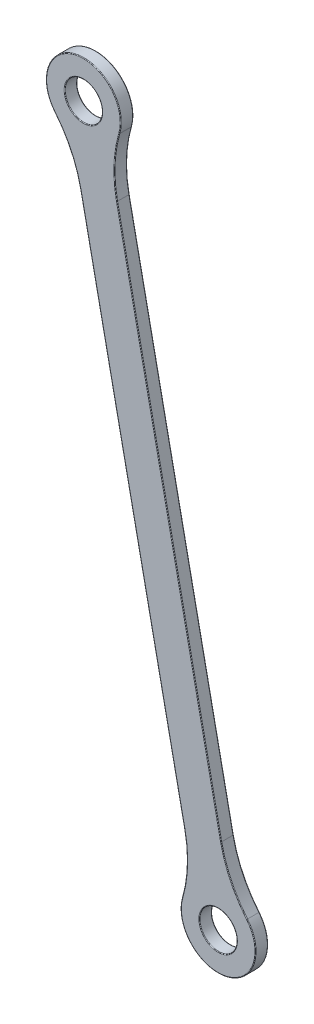
ISO-10303-21;
HEADER;
FILE_DESCRIPTION(('STEP AP214'),'2;1');
FILE_NAME('part.step','',(''),(''),'','','');
FILE_SCHEMA(('AUTOMOTIVE_DESIGN { 1 0 10303 214 1 1 1 1 }'));
ENDSEC;
DATA;
#1=APPLICATION_CONTEXT('core data for automotive mechanical design processes');
#2=APPLICATION_PROTOCOL_DEFINITION('international standard','automotive_design',2000,#1);
#3=PRODUCT_CONTEXT('',#1,'mechanical');
#4=PRODUCT('Part','Part','',(#3));
#5=PRODUCT_RELATED_PRODUCT_CATEGORY('part','',(#4));
#6=PRODUCT_DEFINITION_FORMATION('','',#4);
#7=PRODUCT_DEFINITION_CONTEXT('part definition',#1,'design');
#8=PRODUCT_DEFINITION('design','',#6,#7);
#9=PRODUCT_DEFINITION_SHAPE('','',#8);
#10=(LENGTH_UNIT() NAMED_UNIT(*) SI_UNIT(.MILLI.,.METRE.));
#11=(NAMED_UNIT(*) PLANE_ANGLE_UNIT() SI_UNIT($,.RADIAN.));
#12=(NAMED_UNIT(*) SI_UNIT($,.STERADIAN.) SOLID_ANGLE_UNIT());
#13=UNCERTAINTY_MEASURE_WITH_UNIT(LENGTH_MEASURE(1.E-05),#10,'distance_accuracy_value','');
#14=(GEOMETRIC_REPRESENTATION_CONTEXT(3) GLOBAL_UNCERTAINTY_ASSIGNED_CONTEXT((#13)) GLOBAL_UNIT_ASSIGNED_CONTEXT((#10,
#11,#12)) REPRESENTATION_CONTEXT('',''));
#15=CARTESIAN_POINT('',(0.,0.,0.));
#16=DIRECTION('',(0.,0.,1.));
#17=DIRECTION('',(1.,0.,0.));
#18=AXIS2_PLACEMENT_3D('',#15,#16,#17);
#19=CARTESIAN_POINT('',(33.78,49.7570889759445,3.));
#20=DIRECTION('',(0.,0.,-1.));
#21=DIRECTION('',(-1.,0.,0.));
#22=AXIS2_PLACEMENT_3D('',#19,#20,#21);
#23=CYLINDRICAL_SURFACE('',#22,9.);
#24=DIRECTION('',(0.,0.,-1.));
#25=VECTOR('',#24,1.);
#26=CARTESIAN_POINT('',(25.1327859363434,52.252222025964,3.));
#27=LINE('',#26,#25);
#28=CARTESIAN_POINT('',(25.1327859363434,52.252222025964,2.85));
#29=VERTEX_POINT('',#28);
#30=CARTESIAN_POINT('',(25.1327859363434,52.252222025964,0.15));
#31=VERTEX_POINT('',#30);
#32=EDGE_CURVE('E333',#29,#31,#27,.T.);
#33=ORIENTED_EDGE('',*,*,#32,.T.);
#34=CARTESIAN_POINT('',(33.78,49.7570889759445,0.15));
#35=DIRECTION('',(0.,0.,1.));
#36=DIRECTION('',(1.,0.,0.));
#37=AXIS2_PLACEMENT_3D('',#34,#35,#36);
#38=CIRCLE('',#37,9.);
#39=CARTESIAN_POINT('',(40.7250033658496,55.4813293839233,0.15));
#40=VERTEX_POINT('',#39);
#41=EDGE_CURVE('E223',#31,#40,#38,.T.);
#42=ORIENTED_EDGE('',*,*,#41,.T.);
#43=DIRECTION('',(0.,0.,-1.));
#44=VECTOR('',#43,1.);
#45=CARTESIAN_POINT('',(40.7250033658496,55.4813293839233,3.));
#46=LINE('',#45,#44);
#47=CARTESIAN_POINT('',(40.7250033658496,55.4813293839233,2.85));
#48=VERTEX_POINT('',#47);
#49=EDGE_CURVE('E295',#40,#48,#46,.F.);
#50=ORIENTED_EDGE('',*,*,#49,.T.);
#51=CARTESIAN_POINT('',(33.78,49.7570889759445,2.85));
#52=DIRECTION('',(0.,0.,1.));
#53=DIRECTION('',(1.,0.,0.));
#54=AXIS2_PLACEMENT_3D('',#51,#52,#53);
#55=CIRCLE('',#54,9.);
#56=EDGE_CURVE('E221',#48,#29,#55,.F.);
#57=ORIENTED_EDGE('',*,*,#56,.T.);
#58=EDGE_LOOP('',(#33,#42,#50,#57));
#59=FACE_BOUND('',#58,.T.);
#60=ADVANCED_FACE('F35',(#59),#23,.T.);
#61=CARTESIAN_POINT('',(46.6780601183593,9.66690389387618,3.));
#62=DIRECTION('',(-0.979221384461745,-0.202794181900822,0.));
#63=DIRECTION('',(0.202794181900822,-0.979221384461745,0.));
#64=AXIS2_PLACEMENT_3D('',#61,#62,#63);
#65=PLANE('',#64);
#66=DIRECTION('',(0.,0.,1.));
#67=VECTOR('',#66,1.);
#68=CARTESIAN_POINT('',(34.4983730514961,68.4783052868279,0.));
#69=LINE('',#68,#67);
#70=CARTESIAN_POINT('',(34.4983730514961,68.4783052868279,2.85));
#71=VERTEX_POINT('',#70);
#72=CARTESIAN_POINT('',(34.4983730514961,68.4783052868279,0.15));
#73=VERTEX_POINT('',#72);
#74=EDGE_CURVE('E297',#71,#73,#69,.F.);
#75=ORIENTED_EDGE('',*,*,#74,.T.);
#76=DIRECTION('',(-0.202794181900822,0.979221384461745,0.));
#77=VECTOR('',#76,1.);
#78=CARTESIAN_POINT('',(46.6780601183593,9.66690389387618,0.15));
#79=LINE('',#78,#77);
#80=CARTESIAN_POINT('',(9.42755030452798,189.536441816048,0.15));
#81=VERTEX_POINT('',#80);
#82=EDGE_CURVE('E198',#73,#81,#79,.T.);
#83=ORIENTED_EDGE('',*,*,#82,.T.);
#84=DIRECTION('',(0.,0.,1.));
#85=VECTOR('',#84,1.);
#86=CARTESIAN_POINT('',(9.42755030452798,189.536441816048,3.));
#87=LINE('',#86,#85);
#88=CARTESIAN_POINT('',(9.42755030452798,189.536441816048,2.85));
#89=VERTEX_POINT('',#88);
#90=EDGE_CURVE('E331',#81,#89,#87,.T.);
#91=ORIENTED_EDGE('',*,*,#90,.T.);
#92=DIRECTION('',(-0.202794181900822,0.979221384461745,0.));
#93=VECTOR('',#92,1.);
#94=CARTESIAN_POINT('',(34.4983730514961,68.4783052868279,2.85));
#95=LINE('',#94,#93);
#96=EDGE_CURVE('E196',#89,#71,#95,.F.);
#97=ORIENTED_EDGE('',*,*,#96,.T.);
#98=EDGE_LOOP('',(#75,#83,#91,#97));
#99=FACE_BOUND('',#98,.T.);
#100=ADVANCED_FACE('F330',(#99),#65,.F.);
#101=CARTESIAN_POINT('',(1.33293089586844,206.432510489824,3.));
#102=DIRECTION('',(0.,0.,-1.));
#103=DIRECTION('',(-1.,0.,0.));
#104=AXIS2_PLACEMENT_3D('',#101,#102,#103);
#105=CYLINDRICAL_SURFACE('',#104,9.);
#106=DIRECTION('',(0.,0.,-1.));
#107=VECTOR('',#106,1.);
#108=CARTESIAN_POINT('',(9.98014495952503,203.937377439804,3.));
#109=LINE('',#108,#107);
#110=CARTESIAN_POINT('',(9.98014495952503,203.937377439804,2.85));
#111=VERTEX_POINT('',#110);
#112=CARTESIAN_POINT('',(9.98014495952503,203.937377439804,0.15));
#113=VERTEX_POINT('',#112);
#114=EDGE_CURVE('E334',#111,#113,#109,.T.);
#115=ORIENTED_EDGE('',*,*,#114,.T.);
#116=CARTESIAN_POINT('',(1.33293089586844,206.432510489824,0.15));
#117=DIRECTION('',(0.,0.,1.));
#118=DIRECTION('',(1.,0.,0.));
#119=AXIS2_PLACEMENT_3D('',#116,#117,#118);
#120=CIRCLE('',#119,9.);
#121=CARTESIAN_POINT('',(-5.61207246998122,200.708270081845,0.15));
#122=VERTEX_POINT('',#121);
#123=EDGE_CURVE('E206',#113,#122,#120,.T.);
#124=ORIENTED_EDGE('',*,*,#123,.T.);
#125=DIRECTION('',(0.,0.,-1.));
#126=VECTOR('',#125,1.);
#127=CARTESIAN_POINT('',(-5.61207246998122,200.708270081845,3.));
#128=LINE('',#127,#126);
#129=CARTESIAN_POINT('',(-5.61207246998122,200.708270081845,2.85));
#130=VERTEX_POINT('',#129);
#131=EDGE_CURVE('E338',#122,#130,#128,.F.);
#132=ORIENTED_EDGE('',*,*,#131,.T.);
#133=CARTESIAN_POINT('',(1.33293089586844,206.432510489824,2.85));
#134=DIRECTION('',(0.,0.,1.));
#135=DIRECTION('',(1.,0.,0.));
#136=AXIS2_PLACEMENT_3D('',#133,#134,#135);
#137=CIRCLE('',#136,9.);
#138=EDGE_CURVE('E204',#130,#111,#137,.F.);
#139=ORIENTED_EDGE('',*,*,#138,.T.);
#140=EDGE_LOOP('',(#115,#124,#132,#139));
#141=FACE_BOUND('',#140,.T.);
#142=ADVANCED_FACE('F371',(#141),#105,.T.);
#143=CARTESIAN_POINT('',(1.33293089586844,206.432510489824,3.));
#144=DIRECTION('',(0.,0.,-1.));
#145=DIRECTION('',(-1.,0.,0.));
#146=AXIS2_PLACEMENT_3D('',#143,#144,#145);
#147=CYLINDRICAL_SURFACE('',#146,4.5);
#148=CARTESIAN_POINT('',(1.33293089586844,206.432510489824,0.15));
#149=DIRECTION('',(0.,0.,1.));
#150=DIRECTION('',(1.,0.,0.));
#151=AXIS2_PLACEMENT_3D('',#148,#149,#150);
#152=CIRCLE('',#151,4.5);
#153=CARTESIAN_POINT('',(5.83293089586845,206.432510489824,0.15));
#154=VERTEX_POINT('',#153);
#155=EDGE_CURVE('E190',#154,#154,#152,.F.);
#156=ORIENTED_EDGE('',*,*,#155,.T.);
#157=EDGE_LOOP('',(#156));
#158=FACE_BOUND('',#157,.T.);
#159=CARTESIAN_POINT('',(1.33293089586844,206.432510489824,2.85));
#160=DIRECTION('',(0.,0.,1.));
#161=DIRECTION('',(1.,0.,0.));
#162=AXIS2_PLACEMENT_3D('',#159,#160,#161);
#163=CIRCLE('',#162,4.5);
#164=CARTESIAN_POINT('',(5.83293089586845,206.432510489824,2.85));
#165=VERTEX_POINT('',#164);
#166=EDGE_CURVE('E187',#165,#165,#163,.T.);
#167=ORIENTED_EDGE('',*,*,#166,.T.);
#168=EDGE_LOOP('',(#167));
#169=FACE_BOUND('',#168,.T.);
#170=ADVANCED_FACE('F619',(#158,#169),#147,.F.);
#171=CARTESIAN_POINT('',(37.8650676582036,7.84175625676878,3.));
#172=DIRECTION('',(-0.979221384461745,-0.202794181900822,0.));
#173=DIRECTION('',(0.202794181900822,-0.979221384461745,0.));
#174=AXIS2_PLACEMENT_3D('',#171,#172,#173);
#175=PLANE('',#174);
#176=DIRECTION('',(0.,0.,-1.));
#177=VECTOR('',#176,1.);
#178=CARTESIAN_POINT('',(0.614557844372268,187.71129417894,3.));
#179=LINE('',#178,#177);
#180=CARTESIAN_POINT('',(0.614557844372268,187.71129417894,2.85));
#181=VERTEX_POINT('',#180);
#182=CARTESIAN_POINT('',(0.614557844372268,187.71129417894,0.15));
#183=VERTEX_POINT('',#182);
#184=EDGE_CURVE('E258',#181,#183,#179,.T.);
#185=ORIENTED_EDGE('',*,*,#184,.T.);
#186=DIRECTION('',(-0.202794181900822,0.979221384461745,0.));
#187=VECTOR('',#186,1.);
#188=CARTESIAN_POINT('',(25.6853805913405,66.6531576497204,0.15));
#189=LINE('',#188,#187);
#190=CARTESIAN_POINT('',(25.6853805913405,66.6531576497204,0.15));
#191=VERTEX_POINT('',#190);
#192=EDGE_CURVE('E215',#183,#191,#189,.F.);
#193=ORIENTED_EDGE('',*,*,#192,.T.);
#194=DIRECTION('',(0.,0.,-1.));
#195=VECTOR('',#194,1.);
#196=CARTESIAN_POINT('',(25.6853805913405,66.6531576497204,3.));
#197=LINE('',#196,#195);
#198=CARTESIAN_POINT('',(25.6853805913405,66.6531576497204,2.85));
#199=VERTEX_POINT('',#198);
#200=EDGE_CURVE('E305',#191,#199,#197,.F.);
#201=ORIENTED_EDGE('',*,*,#200,.T.);
#202=DIRECTION('',(-0.202794181900822,0.979221384461745,0.));
#203=VECTOR('',#202,1.);
#204=CARTESIAN_POINT('',(37.8650676582036,7.84175625676878,2.85));
#205=LINE('',#204,#203);
#206=EDGE_CURVE('E213',#199,#181,#205,.T.);
#207=ORIENTED_EDGE('',*,*,#206,.T.);
#208=EDGE_LOOP('',(#185,#193,#201,#207));
#209=FACE_BOUND('',#208,.T.);
#210=ADVANCED_FACE('F346',(#209),#175,.T.);
#211=CARTESIAN_POINT('',(33.78,49.7570889759445,3.));
#212=DIRECTION('',(0.,0.,-1.));
#213=DIRECTION('',(-1.,0.,0.));
#214=AXIS2_PLACEMENT_3D('',#211,#212,#213);
#215=CYLINDRICAL_SURFACE('',#214,4.5);
#216=CARTESIAN_POINT('',(33.78,49.7570889759445,0.15));
#217=DIRECTION('',(0.,0.,1.));
#218=DIRECTION('',(1.,0.,0.));
#219=AXIS2_PLACEMENT_3D('',#216,#217,#218);
#220=CIRCLE('',#219,4.5);
#221=CARTESIAN_POINT('',(38.28,49.7570889759445,0.15));
#222=VERTEX_POINT('',#221);
#223=EDGE_CURVE('E170',#222,#222,#220,.F.);
#224=ORIENTED_EDGE('',*,*,#223,.T.);
#225=EDGE_LOOP('',(#224));
#226=FACE_BOUND('',#225,.T.);
#227=CARTESIAN_POINT('',(33.78,49.7570889759445,2.85));
#228=DIRECTION('',(0.,0.,1.));
#229=DIRECTION('',(1.,0.,0.));
#230=AXIS2_PLACEMENT_3D('',#227,#228,#229);
#231=CIRCLE('',#230,4.5);
#232=CARTESIAN_POINT('',(38.28,49.7570889759445,2.85));
#233=VERTEX_POINT('',#232);
#234=EDGE_CURVE('E301',#233,#233,#231,.T.);
#235=ORIENTED_EDGE('',*,*,#234,.T.);
#236=EDGE_LOOP('',(#235));
#237=FACE_BOUND('',#236,.T.);
#238=ADVANCED_FACE('F604',(#226,#237),#215,.F.);
#239=CARTESIAN_POINT('',(0.,0.,3.));
#240=DIRECTION('',(0.,0.,1.));
#241=DIRECTION('',(1.,0.,0.));
#242=AXIS2_PLACEMENT_3D('',#239,#240,#241);
#243=PLANE('',#242);
#244=CARTESIAN_POINT('',(33.78,49.7570889759445,3.));
#245=DIRECTION('',(0.,0.,1.));
#246=DIRECTION('',(1.,0.,0.));
#247=AXIS2_PLACEMENT_3D('',#244,#245,#246);
#248=CIRCLE('',#247,4.65);
#249=CARTESIAN_POINT('',(38.43,49.7570889759445,3.));
#250=VERTEX_POINT('',#249);
#251=EDGE_CURVE('E11',#250,#250,#248,.F.);
#252=ORIENTED_EDGE('',*,*,#251,.T.);
#253=EDGE_LOOP('',(#252));
#254=FACE_BOUND('',#253,.T.);
#255=CARTESIAN_POINT('',(1.33293089586844,206.432510489824,3.));
#256=DIRECTION('',(0.,0.,1.));
#257=DIRECTION('',(1.,0.,0.));
#258=AXIS2_PLACEMENT_3D('',#255,#256,#257);
#259=CIRCLE('',#258,4.65);
#260=CARTESIAN_POINT('',(5.98293089586845,206.432510489824,3.));
#261=VERTEX_POINT('',#260);
#262=EDGE_CURVE('E44',#261,#261,#259,.F.);
#263=ORIENTED_EDGE('',*,*,#262,.T.);
#264=EDGE_LOOP('',(#263));
#265=FACE_BOUND('',#264,.T.);
#266=CARTESIAN_POINT('',(1.33293089586844,206.432510489824,3.));
#267=DIRECTION('',(0.,0.,1.));
#268=DIRECTION('',(1.,0.,0.));
#269=AXIS2_PLACEMENT_3D('',#266,#267,#268);
#270=CIRCLE('',#269,8.85);
#271=CARTESIAN_POINT('',(9.83602472513076,203.978962990638,3.));
#272=VERTEX_POINT('',#271);
#273=CARTESIAN_POINT('',(-5.49632241388373,200.803674088645,3.));
#274=VERTEX_POINT('',#273);
#275=EDGE_CURVE('E52',#272,#274,#270,.T.);
#276=ORIENTED_EDGE('',*,*,#275,.T.);
#277=CARTESIAN_POINT('',(-28.7620836894801,181.627468721916,3.));
#278=DIRECTION('',(0.,0.,1.));
#279=DIRECTION('',(1.,0.,0.));
#280=AXIS2_PLACEMENT_3D('',#277,#278,#279);
#281=CIRCLE('',#280,30.15);
#282=CARTESIAN_POINT('',(0.76144105204153,187.741713306225,3.));
#283=VERTEX_POINT('',#282);
#284=EDGE_CURVE('E237',#274,#283,#281,.F.);
#285=ORIENTED_EDGE('',*,*,#284,.T.);
#286=DIRECTION('',(-0.202794181900822,0.979221384461745,0.));
#287=VECTOR('',#286,1.);
#288=CARTESIAN_POINT('',(38.0119508658728,7.8721753840539,3.));
#289=LINE('',#288,#287);
#290=CARTESIAN_POINT('',(25.8322637990097,66.6835767770055,3.));
#291=VERTEX_POINT('',#290);
#292=EDGE_CURVE('E225',#283,#291,#289,.F.);
#293=ORIENTED_EDGE('',*,*,#292,.T.);
#294=CARTESIAN_POINT('',(-3.69126094251188,60.5693321926957,3.));
#295=DIRECTION('',(0.,0.,1.));
#296=DIRECTION('',(1.,0.,0.));
#297=AXIS2_PLACEMENT_3D('',#294,#295,#296);
#298=CIRCLE('',#297,30.15);
#299=CARTESIAN_POINT('',(25.2769061707377,52.2106364751303,3.));
#300=VERTEX_POINT('',#299);
#301=EDGE_CURVE('E227',#291,#300,#298,.F.);
#302=ORIENTED_EDGE('',*,*,#301,.T.);
#303=CARTESIAN_POINT('',(33.78,49.7570889759445,3.));
#304=DIRECTION('',(0.,0.,1.));
#305=DIRECTION('',(1.,0.,0.));
#306=AXIS2_PLACEMENT_3D('',#303,#304,#305);
#307=CIRCLE('',#306,8.85);
#308=CARTESIAN_POINT('',(40.6092533097522,55.3859253771236,3.));
#309=VERTEX_POINT('',#308);
#310=EDGE_CURVE('E229',#300,#309,#307,.T.);
#311=ORIENTED_EDGE('',*,*,#310,.T.);
#312=CARTESIAN_POINT('',(63.8750145853485,74.5621307438525,3.));
#313=DIRECTION('',(0.,0.,1.));
#314=DIRECTION('',(1.,0.,0.));
#315=AXIS2_PLACEMENT_3D('',#312,#313,#314);
#316=CIRCLE('',#315,30.15);
#317=CARTESIAN_POINT('',(34.3514898438269,68.4478861595427,3.));
#318=VERTEX_POINT('',#317);
#319=EDGE_CURVE('E231',#309,#318,#316,.F.);
#320=ORIENTED_EDGE('',*,*,#319,.T.);
#321=DIRECTION('',(-0.202794181900822,0.979221384461745,0.));
#322=VECTOR('',#321,1.);
#323=CARTESIAN_POINT('',(9.28066709685869,189.506022688763,3.));
#324=LINE('',#323,#322);
#325=CARTESIAN_POINT('',(9.28066709685871,189.506022688763,3.));
#326=VERTEX_POINT('',#325);
#327=EDGE_CURVE('E233',#318,#326,#324,.T.);
#328=ORIENTED_EDGE('',*,*,#327,.T.);
#329=CARTESIAN_POINT('',(38.8041918383803,195.620267273072,3.));
#330=DIRECTION('',(0.,0.,1.));
#331=DIRECTION('',(1.,0.,0.));
#332=AXIS2_PLACEMENT_3D('',#329,#330,#331);
#333=CIRCLE('',#332,30.15);
#334=EDGE_CURVE('E57',#326,#272,#333,.F.);
#335=ORIENTED_EDGE('',*,*,#334,.T.);
#336=EDGE_LOOP('',(#276,#285,#293,#302,#311,#320,#328,#335));
#337=FACE_BOUND('',#336,.T.);
#338=ADVANCED_FACE('F389',(#254,#265,#337),#243,.T.);
#339=CARTESIAN_POINT('',(0.,0.,0.));
#340=DIRECTION('',(0.,0.,1.));
#341=DIRECTION('',(1.,0.,0.));
#342=AXIS2_PLACEMENT_3D('',#339,#340,#341);
#343=PLANE('',#342);
#344=CARTESIAN_POINT('',(33.78,49.7570889759445,0.));
#345=DIRECTION('',(0.,0.,1.));
#346=DIRECTION('',(1.,0.,0.));
#347=AXIS2_PLACEMENT_3D('',#344,#345,#346);
#348=CIRCLE('',#347,4.65);
#349=CARTESIAN_POINT('',(38.43,49.7570889759445,0.));
#350=VERTEX_POINT('',#349);
#351=EDGE_CURVE('E179',#350,#350,#348,.T.);
#352=ORIENTED_EDGE('',*,*,#351,.T.);
#353=EDGE_LOOP('',(#352));
#354=FACE_BOUND('',#353,.T.);
#355=CARTESIAN_POINT('',(1.33293089586844,206.432510489824,0.));
#356=DIRECTION('',(0.,0.,1.));
#357=DIRECTION('',(1.,0.,0.));
#358=AXIS2_PLACEMENT_3D('',#355,#356,#357);
#359=CIRCLE('',#358,4.65);
#360=CARTESIAN_POINT('',(5.98293089586845,206.432510489824,0.));
#361=VERTEX_POINT('',#360);
#362=EDGE_CURVE('E176',#361,#361,#359,.T.);
#363=ORIENTED_EDGE('',*,*,#362,.T.);
#364=EDGE_LOOP('',(#363));
#365=FACE_BOUND('',#364,.T.);
#366=DIRECTION('',(-0.202794181900822,0.979221384461745,0.));
#367=VECTOR('',#366,1.);
#368=CARTESIAN_POINT('',(46.53117691069,9.63648476659105,0.));
#369=LINE('',#368,#367);
#370=CARTESIAN_POINT('',(9.28066709685871,189.506022688763,0.));
#371=VERTEX_POINT('',#370);
#372=CARTESIAN_POINT('',(34.3514898438269,68.4478861595427,0.));
#373=VERTEX_POINT('',#372);
#374=EDGE_CURVE('E174',#371,#373,#369,.F.);
#375=ORIENTED_EDGE('',*,*,#374,.T.);
#376=CARTESIAN_POINT('',(63.8750145853485,74.5621307438525,0.));
#377=DIRECTION('',(0.,0.,1.));
#378=DIRECTION('',(1.,0.,0.));
#379=AXIS2_PLACEMENT_3D('',#376,#377,#378);
#380=CIRCLE('',#379,30.15);
#381=CARTESIAN_POINT('',(40.6092533097522,55.3859253771236,0.));
#382=VERTEX_POINT('',#381);
#383=EDGE_CURVE('E155',#373,#382,#380,.T.);
#384=ORIENTED_EDGE('',*,*,#383,.T.);
#385=CARTESIAN_POINT('',(33.78,49.7570889759445,0.));
#386=DIRECTION('',(0.,0.,1.));
#387=DIRECTION('',(1.,0.,0.));
#388=AXIS2_PLACEMENT_3D('',#385,#386,#387);
#389=CIRCLE('',#388,8.85);
#390=CARTESIAN_POINT('',(25.2769061707377,52.2106364751303,0.));
#391=VERTEX_POINT('',#390);
#392=EDGE_CURVE('E163',#382,#391,#389,.F.);
#393=ORIENTED_EDGE('',*,*,#392,.T.);
#394=CARTESIAN_POINT('',(-3.69126094251188,60.5693321926957,0.));
#395=DIRECTION('',(0.,0.,1.));
#396=DIRECTION('',(1.,0.,0.));
#397=AXIS2_PLACEMENT_3D('',#394,#395,#396);
#398=CIRCLE('',#397,30.15);
#399=CARTESIAN_POINT('',(25.8322637990097,66.6835767770055,0.));
#400=VERTEX_POINT('',#399);
#401=EDGE_CURVE('E169',#391,#400,#398,.T.);
#402=ORIENTED_EDGE('',*,*,#401,.T.);
#403=DIRECTION('',(-0.202794181900822,0.979221384461745,0.));
#404=VECTOR('',#403,1.);
#405=CARTESIAN_POINT('',(0.761441052041518,187.741713306226,0.));
#406=LINE('',#405,#404);
#407=CARTESIAN_POINT('',(0.76144105204153,187.741713306225,0.));
#408=VERTEX_POINT('',#407);
#409=EDGE_CURVE('E312',#400,#408,#406,.T.);
#410=ORIENTED_EDGE('',*,*,#409,.T.);
#411=CARTESIAN_POINT('',(-28.7620836894801,181.627468721916,0.));
#412=DIRECTION('',(0.,0.,1.));
#413=DIRECTION('',(1.,0.,0.));
#414=AXIS2_PLACEMENT_3D('',#411,#412,#413);
#415=CIRCLE('',#414,30.15);
#416=CARTESIAN_POINT('',(-5.49632241388373,200.803674088645,0.));
#417=VERTEX_POINT('',#416);
#418=EDGE_CURVE('E314',#408,#417,#415,.T.);
#419=ORIENTED_EDGE('',*,*,#418,.T.);
#420=CARTESIAN_POINT('',(1.33293089586844,206.432510489824,0.));
#421=DIRECTION('',(0.,0.,1.));
#422=DIRECTION('',(1.,0.,0.));
#423=AXIS2_PLACEMENT_3D('',#420,#421,#422);
#424=CIRCLE('',#423,8.85);
#425=CARTESIAN_POINT('',(9.83602472513076,203.978962990638,0.));
#426=VERTEX_POINT('',#425);
#427=EDGE_CURVE('E316',#417,#426,#424,.F.);
#428=ORIENTED_EDGE('',*,*,#427,.T.);
#429=CARTESIAN_POINT('',(38.8041918383803,195.620267273072,0.));
#430=DIRECTION('',(0.,0.,1.));
#431=DIRECTION('',(1.,0.,0.));
#432=AXIS2_PLACEMENT_3D('',#429,#430,#431);
#433=CIRCLE('',#432,30.15);
#434=EDGE_CURVE('E181',#426,#371,#433,.T.);
#435=ORIENTED_EDGE('',*,*,#434,.T.);
#436=EDGE_LOOP('',(#375,#384,#393,#402,#410,#419,#428,#435));
#437=FACE_BOUND('',#436,.T.);
#438=ADVANCED_FACE('F172',(#354,#365,#437),#343,.F.);
#439=CARTESIAN_POINT('',(-28.7620836894801,181.627468721916,3.));
#440=DIRECTION('',(0.,0.,-1.));
#441=DIRECTION('',(-1.,0.,0.));
#442=AXIS2_PLACEMENT_3D('',#439,#440,#441);
#443=CYLINDRICAL_SURFACE('',#442,30.);
#444=ORIENTED_EDGE('',*,*,#131,.F.);
#445=CARTESIAN_POINT('',(-28.7620836894801,181.627468721916,0.15));
#446=DIRECTION('',(0.,0.,1.));
#447=DIRECTION('',(1.,0.,0.));
#448=AXIS2_PLACEMENT_3D('',#445,#446,#447);
#449=CIRCLE('',#448,30.);
#450=EDGE_CURVE('E211',#122,#183,#449,.F.);
#451=ORIENTED_EDGE('',*,*,#450,.T.);
#452=ORIENTED_EDGE('',*,*,#184,.F.);
#453=CARTESIAN_POINT('',(-28.7620836894801,181.627468721916,2.85));
#454=DIRECTION('',(0.,0.,1.));
#455=DIRECTION('',(1.,0.,0.));
#456=AXIS2_PLACEMENT_3D('',#453,#454,#455);
#457=CIRCLE('',#456,30.);
#458=EDGE_CURVE('E208',#181,#130,#457,.T.);
#459=ORIENTED_EDGE('',*,*,#458,.T.);
#460=EDGE_LOOP('',(#444,#451,#452,#459));
#461=FACE_BOUND('',#460,.T.);
#462=ADVANCED_FACE('F368',(#461),#443,.F.);
#463=CARTESIAN_POINT('',(38.8041918383803,195.620267273072,3.));
#464=DIRECTION('',(0.,0.,-1.));
#465=DIRECTION('',(-1.,0.,0.));
#466=AXIS2_PLACEMENT_3D('',#463,#464,#465);
#467=CYLINDRICAL_SURFACE('',#466,30.);
#468=ORIENTED_EDGE('',*,*,#90,.F.);
#469=CARTESIAN_POINT('',(38.8041918383803,195.620267273072,0.15));
#470=DIRECTION('',(0.,0.,1.));
#471=DIRECTION('',(1.,0.,0.));
#472=AXIS2_PLACEMENT_3D('',#469,#470,#471);
#473=CIRCLE('',#472,30.);
#474=EDGE_CURVE('E202',#81,#113,#473,.F.);
#475=ORIENTED_EDGE('',*,*,#474,.T.);
#476=ORIENTED_EDGE('',*,*,#114,.F.);
#477=CARTESIAN_POINT('',(38.8041918383803,195.620267273072,2.85));
#478=DIRECTION('',(0.,0.,1.));
#479=DIRECTION('',(1.,0.,0.));
#480=AXIS2_PLACEMENT_3D('',#477,#478,#479);
#481=CIRCLE('',#480,30.);
#482=EDGE_CURVE('E200',#111,#89,#481,.T.);
#483=ORIENTED_EDGE('',*,*,#482,.T.);
#484=EDGE_LOOP('',(#468,#475,#476,#483));
#485=FACE_BOUND('',#484,.T.);
#486=ADVANCED_FACE('F413',(#485),#467,.F.);
#487=CARTESIAN_POINT('',(-3.69126094251188,60.5693321926957,3.));
#488=DIRECTION('',(0.,0.,-1.));
#489=DIRECTION('',(-1.,0.,0.));
#490=AXIS2_PLACEMENT_3D('',#487,#488,#489);
#491=CYLINDRICAL_SURFACE('',#490,30.);
#492=ORIENTED_EDGE('',*,*,#200,.F.);
#493=CARTESIAN_POINT('',(-3.69126094251188,60.5693321926957,0.15));
#494=DIRECTION('',(0.,0.,1.));
#495=DIRECTION('',(1.,0.,0.));
#496=AXIS2_PLACEMENT_3D('',#493,#494,#495);
#497=CIRCLE('',#496,30.);
#498=EDGE_CURVE('E219',#191,#31,#497,.F.);
#499=ORIENTED_EDGE('',*,*,#498,.T.);
#500=ORIENTED_EDGE('',*,*,#32,.F.);
#501=CARTESIAN_POINT('',(-3.69126094251188,60.5693321926957,2.85));
#502=DIRECTION('',(0.,0.,1.));
#503=DIRECTION('',(1.,0.,0.));
#504=AXIS2_PLACEMENT_3D('',#501,#502,#503);
#505=CIRCLE('',#504,30.);
#506=EDGE_CURVE('E217',#29,#199,#505,.T.);
#507=ORIENTED_EDGE('',*,*,#506,.T.);
#508=EDGE_LOOP('',(#492,#499,#500,#507));
#509=FACE_BOUND('',#508,.T.);
#510=ADVANCED_FACE('F386',(#509),#491,.F.);
#511=CARTESIAN_POINT('',(63.8750145853485,74.5621307438525,3.));
#512=DIRECTION('',(0.,0.,-1.));
#513=DIRECTION('',(-1.,0.,0.));
#514=AXIS2_PLACEMENT_3D('',#511,#512,#513);
#515=CYLINDRICAL_SURFACE('',#514,30.);
#516=ORIENTED_EDGE('',*,*,#49,.F.);
#517=CARTESIAN_POINT('',(63.8750145853485,74.5621307438525,0.15));
#518=DIRECTION('',(0.,0.,1.));
#519=DIRECTION('',(1.,0.,0.));
#520=AXIS2_PLACEMENT_3D('',#517,#518,#519);
#521=CIRCLE('',#520,30.);
#522=EDGE_CURVE('E157',#40,#73,#521,.F.);
#523=ORIENTED_EDGE('',*,*,#522,.T.);
#524=ORIENTED_EDGE('',*,*,#74,.F.);
#525=CARTESIAN_POINT('',(63.8750145853485,74.5621307438525,2.85));
#526=DIRECTION('',(0.,0.,1.));
#527=DIRECTION('',(1.,0.,0.));
#528=AXIS2_PLACEMENT_3D('',#525,#526,#527);
#529=CIRCLE('',#528,30.);
#530=EDGE_CURVE('E193',#71,#48,#529,.T.);
#531=ORIENTED_EDGE('',*,*,#530,.T.);
#532=EDGE_LOOP('',(#516,#523,#524,#531));
#533=FACE_BOUND('',#532,.T.);
#534=ADVANCED_FACE('F294',(#533),#515,.F.);
#535=CARTESIAN_POINT('',(33.78,49.7570889759445,0.15));
#536=DIRECTION('',(0.,0.,1.));
#537=DIRECTION('',(1.,0.,0.));
#538=AXIS2_PLACEMENT_3D('',#535,#536,#537);
#539=TOROIDAL_SURFACE('',#538,4.65,0.15);
#540=ORIENTED_EDGE('',*,*,#351,.F.);
#541=EDGE_LOOP('',(#540));
#542=FACE_BOUND('',#541,.T.);
#543=ORIENTED_EDGE('',*,*,#223,.F.);
#544=EDGE_LOOP('',(#543));
#545=FACE_BOUND('',#544,.T.);
#546=ADVANCED_FACE('F420',(#542,#545),#539,.T.);
#547=CARTESIAN_POINT('',(1.33293089586844,206.432510489824,0.15));
#548=DIRECTION('',(0.,0.,1.));
#549=DIRECTION('',(1.,0.,0.));
#550=AXIS2_PLACEMENT_3D('',#547,#548,#549);
#551=TOROIDAL_SURFACE('',#550,4.65,0.15);
#552=ORIENTED_EDGE('',*,*,#155,.F.);
#553=EDGE_LOOP('',(#552));
#554=FACE_BOUND('',#553,.T.);
#555=ORIENTED_EDGE('',*,*,#362,.F.);
#556=EDGE_LOOP('',(#555));
#557=FACE_BOUND('',#556,.T.);
#558=ADVANCED_FACE('F423',(#554,#557),#551,.T.);
#559=CARTESIAN_POINT('',(-28.7620836894801,181.627468721916,0.15));
#560=DIRECTION('',(0.,0.,1.));
#561=DIRECTION('',(1.,0.,0.));
#562=AXIS2_PLACEMENT_3D('',#559,#560,#561);
#563=TOROIDAL_SURFACE('',#562,30.15,0.15);
#564=CARTESIAN_POINT('',(0.761441052041527,187.741713306225,0.15));
#565=DIRECTION('',(0.202794181900869,-0.979221384461735,0.));
#566=DIRECTION('',(0.979221384461735,0.202794181900869,0.));
#567=AXIS2_PLACEMENT_3D('',#564,#565,#566);
#568=CIRCLE('',#567,0.15);
#569=EDGE_CURVE('E252',#183,#408,#568,.T.);
#570=ORIENTED_EDGE('',*,*,#569,.F.);
#571=ORIENTED_EDGE('',*,*,#450,.F.);
#572=CARTESIAN_POINT('',(-5.49632241388373,200.803674088645,0.15));
#573=DIRECTION('',(-0.636026711997582,0.771667040650011,0.));
#574=DIRECTION('',(-0.771667040650011,-0.636026711997582,0.));
#575=AXIS2_PLACEMENT_3D('',#572,#573,#574);
#576=CIRCLE('',#575,0.15);
#577=EDGE_CURVE('E255',#417,#122,#576,.T.);
#578=ORIENTED_EDGE('',*,*,#577,.F.);
#579=ORIENTED_EDGE('',*,*,#418,.F.);
#580=EDGE_LOOP('',(#570,#571,#578,#579));
#581=FACE_BOUND('',#580,.T.);
#582=ADVANCED_FACE('F378',(#581),#563,.T.);
#583=CARTESIAN_POINT('',(1.33293089586844,206.432510489824,0.15));
#584=DIRECTION('',(0.,0.,1.));
#585=DIRECTION('',(1.,0.,0.));
#586=AXIS2_PLACEMENT_3D('',#583,#584,#585);
#587=TOROIDAL_SURFACE('',#586,8.85,0.15);
#588=ORIENTED_EDGE('',*,*,#577,.T.);
#589=ORIENTED_EDGE('',*,*,#123,.F.);
#590=CARTESIAN_POINT('',(9.83602472513076,203.978962990638,0.15));
#591=DIRECTION('',(-0.27723700555778,-0.960801562628493,0.));
#592=DIRECTION('',(0.960801562628494,-0.277237005557781,0.));
#593=AXIS2_PLACEMENT_3D('',#590,#591,#592);
#594=CIRCLE('',#593,0.15);
#595=EDGE_CURVE('E249',#426,#113,#594,.T.);
#596=ORIENTED_EDGE('',*,*,#595,.F.);
#597=ORIENTED_EDGE('',*,*,#427,.F.);
#598=EDGE_LOOP('',(#588,#589,#596,#597));
#599=FACE_BOUND('',#598,.T.);
#600=ADVANCED_FACE('F441',(#599),#587,.T.);
#601=CARTESIAN_POINT('',(38.0119508658728,7.8721753840539,0.15));
#602=DIRECTION('',(0.202794181900822,-0.979221384461745,0.));
#603=DIRECTION('',(0.979221384461745,0.202794181900822,0.));
#604=AXIS2_PLACEMENT_3D('',#601,#602,#603);
#605=CYLINDRICAL_SURFACE('',#604,0.15);
#606=ORIENTED_EDGE('',*,*,#569,.T.);
#607=ORIENTED_EDGE('',*,*,#409,.F.);
#608=CARTESIAN_POINT('',(25.8322637990097,66.6835767770055,0.15));
#609=DIRECTION('',(0.202794181900782,-0.979221384461753,0.));
#610=DIRECTION('',(0.979221384461753,0.202794181900782,0.));
#611=AXIS2_PLACEMENT_3D('',#608,#609,#610);
#612=CIRCLE('',#611,0.15);
#613=EDGE_CURVE('E246',#191,#400,#612,.T.);
#614=ORIENTED_EDGE('',*,*,#613,.F.);
#615=ORIENTED_EDGE('',*,*,#192,.F.);
#616=EDGE_LOOP('',(#606,#607,#614,#615));
#617=FACE_BOUND('',#616,.T.);
#618=ADVANCED_FACE('F382',(#617),#605,.T.);
#619=CARTESIAN_POINT('',(38.8041918383803,195.620267273072,0.15));
#620=DIRECTION('',(0.,0.,1.));
#621=DIRECTION('',(1.,0.,0.));
#622=AXIS2_PLACEMENT_3D('',#619,#620,#621);
#623=TOROIDAL_SURFACE('',#622,30.15,0.15);
#624=ORIENTED_EDGE('',*,*,#595,.T.);
#625=ORIENTED_EDGE('',*,*,#474,.F.);
#626=CARTESIAN_POINT('',(9.28066709685871,189.506022688763,0.15));
#627=DIRECTION('',(0.202794181900859,-0.979221384461737,0.));
#628=DIRECTION('',(0.979221384461737,0.202794181900859,0.));
#629=AXIS2_PLACEMENT_3D('',#626,#627,#628);
#630=CIRCLE('',#629,0.15);
#631=EDGE_CURVE('E243',#371,#81,#630,.T.);
#632=ORIENTED_EDGE('',*,*,#631,.F.);
#633=ORIENTED_EDGE('',*,*,#434,.F.);
#634=EDGE_LOOP('',(#624,#625,#632,#633));
#635=FACE_BOUND('',#634,.T.);
#636=ADVANCED_FACE('F323',(#635),#623,.T.);
#637=CARTESIAN_POINT('',(-3.69126094251188,60.5693321926957,0.15));
#638=DIRECTION('',(0.,0.,1.));
#639=DIRECTION('',(1.,0.,0.));
#640=AXIS2_PLACEMENT_3D('',#637,#638,#639);
#641=TOROIDAL_SURFACE('',#640,30.15,0.15);
#642=ORIENTED_EDGE('',*,*,#613,.T.);
#643=ORIENTED_EDGE('',*,*,#401,.F.);
#644=CARTESIAN_POINT('',(25.2769061707377,52.2106364751303,0.15));
#645=DIRECTION('',(-0.277237005557735,-0.960801562628507,0.));
#646=DIRECTION('',(0.960801562628507,-0.277237005557735,0.));
#647=AXIS2_PLACEMENT_3D('',#644,#645,#646);
#648=CIRCLE('',#647,0.15);
#649=EDGE_CURVE('E166',#31,#391,#648,.T.);
#650=ORIENTED_EDGE('',*,*,#649,.F.);
#651=ORIENTED_EDGE('',*,*,#498,.F.);
#652=EDGE_LOOP('',(#642,#643,#650,#651));
#653=FACE_BOUND('',#652,.T.);
#654=ADVANCED_FACE('F385',(#653),#641,.T.);
#655=CARTESIAN_POINT('',(46.53117691069,9.63648476659105,0.15));
#656=DIRECTION('',(-0.202794181900822,0.979221384461745,0.));
#657=DIRECTION('',(-0.979221384461745,-0.202794181900822,0.));
#658=AXIS2_PLACEMENT_3D('',#655,#656,#657);
#659=CYLINDRICAL_SURFACE('',#658,0.15);
#660=ORIENTED_EDGE('',*,*,#631,.T.);
#661=ORIENTED_EDGE('',*,*,#82,.F.);
#662=CARTESIAN_POINT('',(34.3514898438269,68.4478861595427,0.15));
#663=DIRECTION('',(0.202794181900777,-0.979221384461754,0.));
#664=DIRECTION('',(0.979221384461754,0.202794181900777,0.));
#665=AXIS2_PLACEMENT_3D('',#662,#663,#664);
#666=CIRCLE('',#665,0.15);
#667=EDGE_CURVE('E160',#373,#73,#666,.T.);
#668=ORIENTED_EDGE('',*,*,#667,.F.);
#669=ORIENTED_EDGE('',*,*,#374,.F.);
#670=EDGE_LOOP('',(#660,#661,#668,#669));
#671=FACE_BOUND('',#670,.T.);
#672=ADVANCED_FACE('F326',(#671),#659,.T.);
#673=CARTESIAN_POINT('',(33.78,49.7570889759445,0.15));
#674=DIRECTION('',(0.,0.,1.));
#675=DIRECTION('',(1.,0.,0.));
#676=AXIS2_PLACEMENT_3D('',#673,#674,#675);
#677=TOROIDAL_SURFACE('',#676,8.85,0.15);
#678=ORIENTED_EDGE('',*,*,#649,.T.);
#679=ORIENTED_EDGE('',*,*,#392,.F.);
#680=CARTESIAN_POINT('',(40.6092533097522,55.3859253771236,0.15));
#681=DIRECTION('',(-0.63602671199764,0.771667040649962,0.));
#682=DIRECTION('',(-0.771667040649962,-0.63602671199764,0.));
#683=AXIS2_PLACEMENT_3D('',#680,#681,#682);
#684=CIRCLE('',#683,0.15);
#685=EDGE_CURVE('E151',#40,#382,#684,.T.);
#686=ORIENTED_EDGE('',*,*,#685,.F.);
#687=ORIENTED_EDGE('',*,*,#41,.F.);
#688=EDGE_LOOP('',(#678,#679,#686,#687));
#689=FACE_BOUND('',#688,.T.);
#690=ADVANCED_FACE('F164',(#689),#677,.T.);
#691=CARTESIAN_POINT('',(63.8750145853485,74.5621307438525,0.15));
#692=DIRECTION('',(0.,0.,1.));
#693=DIRECTION('',(1.,0.,0.));
#694=AXIS2_PLACEMENT_3D('',#691,#692,#693);
#695=TOROIDAL_SURFACE('',#694,30.15,0.15);
#696=ORIENTED_EDGE('',*,*,#667,.T.);
#697=ORIENTED_EDGE('',*,*,#522,.F.);
#698=ORIENTED_EDGE('',*,*,#685,.T.);
#699=ORIENTED_EDGE('',*,*,#383,.F.);
#700=EDGE_LOOP('',(#696,#697,#698,#699));
#701=FACE_BOUND('',#700,.T.);
#702=ADVANCED_FACE('F153',(#701),#695,.T.);
#703=CARTESIAN_POINT('',(33.78,49.7570889759445,2.85));
#704=DIRECTION('',(0.,0.,1.));
#705=DIRECTION('',(1.,0.,0.));
#706=AXIS2_PLACEMENT_3D('',#703,#704,#705);
#707=TOROIDAL_SURFACE('',#706,4.65,0.15);
#708=ORIENTED_EDGE('',*,*,#234,.F.);
#709=EDGE_LOOP('',(#708));
#710=FACE_BOUND('',#709,.T.);
#711=ORIENTED_EDGE('',*,*,#251,.F.);
#712=EDGE_LOOP('',(#711));
#713=FACE_BOUND('',#712,.T.);
#714=ADVANCED_FACE('F430',(#710,#713),#707,.T.);
#715=CARTESIAN_POINT('',(1.33293089586844,206.432510489824,2.85));
#716=DIRECTION('',(0.,0.,1.));
#717=DIRECTION('',(1.,0.,0.));
#718=AXIS2_PLACEMENT_3D('',#715,#716,#717);
#719=TOROIDAL_SURFACE('',#718,4.65,0.15);
#720=ORIENTED_EDGE('',*,*,#262,.F.);
#721=EDGE_LOOP('',(#720));
#722=FACE_BOUND('',#721,.T.);
#723=ORIENTED_EDGE('',*,*,#166,.F.);
#724=EDGE_LOOP('',(#723));
#725=FACE_BOUND('',#724,.T.);
#726=ADVANCED_FACE('F449',(#722,#725),#719,.T.);
#727=CARTESIAN_POINT('',(63.8750145853485,74.5621307438525,2.85));
#728=DIRECTION('',(0.,0.,1.));
#729=DIRECTION('',(1.,0.,0.));
#730=AXIS2_PLACEMENT_3D('',#727,#728,#729);
#731=TOROIDAL_SURFACE('',#730,30.15,0.15);
#732=CARTESIAN_POINT('',(40.6092533097522,55.3859253771236,2.85));
#733=DIRECTION('',(0.63602671199764,-0.771667040649962,0.));
#734=DIRECTION('',(0.771667040649962,0.63602671199764,0.));
#735=AXIS2_PLACEMENT_3D('',#732,#733,#734);
#736=CIRCLE('',#735,0.15);
#737=EDGE_CURVE('E274',#48,#309,#736,.T.);
#738=ORIENTED_EDGE('',*,*,#737,.F.);
#739=ORIENTED_EDGE('',*,*,#530,.F.);
#740=CARTESIAN_POINT('',(34.3514898438269,68.4478861595427,2.85));
#741=DIRECTION('',(-0.202794181900777,0.979221384461754,0.));
#742=DIRECTION('',(-0.979221384461754,-0.202794181900777,0.));
#743=AXIS2_PLACEMENT_3D('',#740,#741,#742);
#744=CIRCLE('',#743,0.15);
#745=EDGE_CURVE('E39',#318,#71,#744,.T.);
#746=ORIENTED_EDGE('',*,*,#745,.F.);
#747=ORIENTED_EDGE('',*,*,#319,.F.);
#748=EDGE_LOOP('',(#738,#739,#746,#747));
#749=FACE_BOUND('',#748,.T.);
#750=ADVANCED_FACE('F37',(#749),#731,.T.);
#751=CARTESIAN_POINT('',(46.53117691069,9.63648476659105,2.85));
#752=DIRECTION('',(0.202794181900822,-0.979221384461745,0.));
#753=DIRECTION('',(0.979221384461745,0.202794181900822,0.));
#754=AXIS2_PLACEMENT_3D('',#751,#752,#753);
#755=CYLINDRICAL_SURFACE('',#754,0.15);
#756=ORIENTED_EDGE('',*,*,#745,.T.);
#757=ORIENTED_EDGE('',*,*,#96,.F.);
#758=CARTESIAN_POINT('',(9.28066709685871,189.506022688763,2.85));
#759=DIRECTION('',(-0.202794181900859,0.979221384461737,0.));
#760=DIRECTION('',(-0.979221384461737,-0.202794181900859,0.));
#761=AXIS2_PLACEMENT_3D('',#758,#759,#760);
#762=CIRCLE('',#761,0.15);
#763=EDGE_CURVE('E272',#326,#89,#762,.T.);
#764=ORIENTED_EDGE('',*,*,#763,.F.);
#765=ORIENTED_EDGE('',*,*,#327,.F.);
#766=EDGE_LOOP('',(#756,#757,#764,#765));
#767=FACE_BOUND('',#766,.T.);
#768=ADVANCED_FACE('F285',(#767),#755,.T.);
#769=CARTESIAN_POINT('',(33.78,49.7570889759445,2.85));
#770=DIRECTION('',(0.,0.,1.));
#771=DIRECTION('',(1.,0.,0.));
#772=AXIS2_PLACEMENT_3D('',#769,#770,#771);
#773=TOROIDAL_SURFACE('',#772,8.85,0.15);
#774=ORIENTED_EDGE('',*,*,#737,.T.);
#775=ORIENTED_EDGE('',*,*,#310,.F.);
#776=CARTESIAN_POINT('',(25.2769061707377,52.2106364751303,2.85));
#777=DIRECTION('',(0.277237005557735,0.960801562628507,0.));
#778=DIRECTION('',(-0.960801562628507,0.277237005557735,0.));
#779=AXIS2_PLACEMENT_3D('',#776,#777,#778);
#780=CIRCLE('',#779,0.15);
#781=EDGE_CURVE('E269',#29,#300,#780,.T.);
#782=ORIENTED_EDGE('',*,*,#781,.F.);
#783=ORIENTED_EDGE('',*,*,#56,.F.);
#784=EDGE_LOOP('',(#774,#775,#782,#783));
#785=FACE_BOUND('',#784,.T.);
#786=ADVANCED_FACE('F388',(#785),#773,.T.);
#787=CARTESIAN_POINT('',(38.8041918383803,195.620267273072,2.85));
#788=DIRECTION('',(0.,0.,1.));
#789=DIRECTION('',(1.,0.,0.));
#790=AXIS2_PLACEMENT_3D('',#787,#788,#789);
#791=TOROIDAL_SURFACE('',#790,30.15,0.15);
#792=ORIENTED_EDGE('',*,*,#763,.T.);
#793=ORIENTED_EDGE('',*,*,#482,.F.);
#794=CARTESIAN_POINT('',(9.83602472513076,203.978962990638,2.85));
#795=DIRECTION('',(0.277237005557768,0.960801562628497,0.));
#796=DIRECTION('',(-0.960801562628497,0.277237005557768,0.));
#797=AXIS2_PLACEMENT_3D('',#794,#795,#796);
#798=CIRCLE('',#797,0.15);
#799=EDGE_CURVE('E266',#272,#111,#798,.T.);
#800=ORIENTED_EDGE('',*,*,#799,.F.);
#801=ORIENTED_EDGE('',*,*,#334,.F.);
#802=EDGE_LOOP('',(#792,#793,#800,#801));
#803=FACE_BOUND('',#802,.T.);
#804=ADVANCED_FACE('F392',(#803),#791,.T.);
#805=CARTESIAN_POINT('',(-3.69126094251188,60.5693321926957,2.85));
#806=DIRECTION('',(0.,0.,1.));
#807=DIRECTION('',(1.,0.,0.));
#808=AXIS2_PLACEMENT_3D('',#805,#806,#807);
#809=TOROIDAL_SURFACE('',#808,30.15,0.15);
#810=ORIENTED_EDGE('',*,*,#781,.T.);
#811=ORIENTED_EDGE('',*,*,#301,.F.);
#812=CARTESIAN_POINT('',(25.8322637990097,66.6835767770055,2.85));
#813=DIRECTION('',(-0.202794181900782,0.979221384461753,0.));
#814=DIRECTION('',(-0.979221384461753,-0.202794181900782,0.));
#815=AXIS2_PLACEMENT_3D('',#812,#813,#814);
#816=CIRCLE('',#815,0.15);
#817=EDGE_CURVE('E263',#199,#291,#816,.T.);
#818=ORIENTED_EDGE('',*,*,#817,.F.);
#819=ORIENTED_EDGE('',*,*,#506,.F.);
#820=EDGE_LOOP('',(#810,#811,#818,#819));
#821=FACE_BOUND('',#820,.T.);
#822=ADVANCED_FACE('F355',(#821),#809,.T.);
#823=CARTESIAN_POINT('',(1.33293089586844,206.432510489824,2.85));
#824=DIRECTION('',(0.,0.,1.));
#825=DIRECTION('',(1.,0.,0.));
#826=AXIS2_PLACEMENT_3D('',#823,#824,#825);
#827=TOROIDAL_SURFACE('',#826,8.85,0.15);
#828=ORIENTED_EDGE('',*,*,#799,.T.);
#829=ORIENTED_EDGE('',*,*,#138,.F.);
#830=CARTESIAN_POINT('',(-5.49632241388373,200.803674088645,2.85));
#831=DIRECTION('',(0.63602671199759,-0.771667040650004,0.));
#832=DIRECTION('',(0.771667040650004,0.63602671199759,0.));
#833=AXIS2_PLACEMENT_3D('',#830,#831,#832);
#834=CIRCLE('',#833,0.15);
#835=EDGE_CURVE('E261',#274,#130,#834,.T.);
#836=ORIENTED_EDGE('',*,*,#835,.F.);
#837=ORIENTED_EDGE('',*,*,#275,.F.);
#838=EDGE_LOOP('',(#828,#829,#836,#837));
#839=FACE_BOUND('',#838,.T.);
#840=ADVANCED_FACE('F394',(#839),#827,.T.);
#841=CARTESIAN_POINT('',(38.0119508658728,7.8721753840539,2.85));
#842=DIRECTION('',(-0.202794181900822,0.979221384461745,0.));
#843=DIRECTION('',(-0.979221384461745,-0.202794181900822,0.));
#844=AXIS2_PLACEMENT_3D('',#841,#842,#843);
#845=CYLINDRICAL_SURFACE('',#844,0.15);
#846=ORIENTED_EDGE('',*,*,#817,.T.);
#847=ORIENTED_EDGE('',*,*,#292,.F.);
#848=CARTESIAN_POINT('',(0.761441052041527,187.741713306225,2.85));
#849=DIRECTION('',(-0.202794181900869,0.979221384461735,0.));
#850=DIRECTION('',(-0.979221384461735,-0.202794181900869,0.));
#851=AXIS2_PLACEMENT_3D('',#848,#849,#850);
#852=CIRCLE('',#851,0.15);
#853=EDGE_CURVE('E259',#181,#283,#852,.T.);
#854=ORIENTED_EDGE('',*,*,#853,.F.);
#855=ORIENTED_EDGE('',*,*,#206,.F.);
#856=EDGE_LOOP('',(#846,#847,#854,#855));
#857=FACE_BOUND('',#856,.T.);
#858=ADVANCED_FACE('F359',(#857),#845,.T.);
#859=CARTESIAN_POINT('',(-28.7620836894801,181.627468721916,2.85));
#860=DIRECTION('',(0.,0.,1.));
#861=DIRECTION('',(1.,0.,0.));
#862=AXIS2_PLACEMENT_3D('',#859,#860,#861);
#863=TOROIDAL_SURFACE('',#862,30.15,0.15);
#864=ORIENTED_EDGE('',*,*,#835,.T.);
#865=ORIENTED_EDGE('',*,*,#458,.F.);
#866=ORIENTED_EDGE('',*,*,#853,.T.);
#867=ORIENTED_EDGE('',*,*,#284,.F.);
#868=EDGE_LOOP('',(#864,#865,#866,#867));
#869=FACE_BOUND('',#868,.T.);
#870=ADVANCED_FACE('F363',(#869),#863,.T.);
#871=CLOSED_SHELL('',(#60,#100,#142,#170,#210,#238,#338,#438,#462,#486,#510,#534,#546,#558,#582,
#600,#618,#636,#654,#672,#690,#702,#714,#726,#750,#768,#786,#804,#822,#840,#858,#870));
#872=MANIFOLD_SOLID_BREP('B2',#871);
#873=ADVANCED_BREP_SHAPE_REPRESENTATION('',(#18,#872),#14);
#874=SHAPE_DEFINITION_REPRESENTATION(#9,#873);
ENDSEC;
END-ISO-10303-21;
